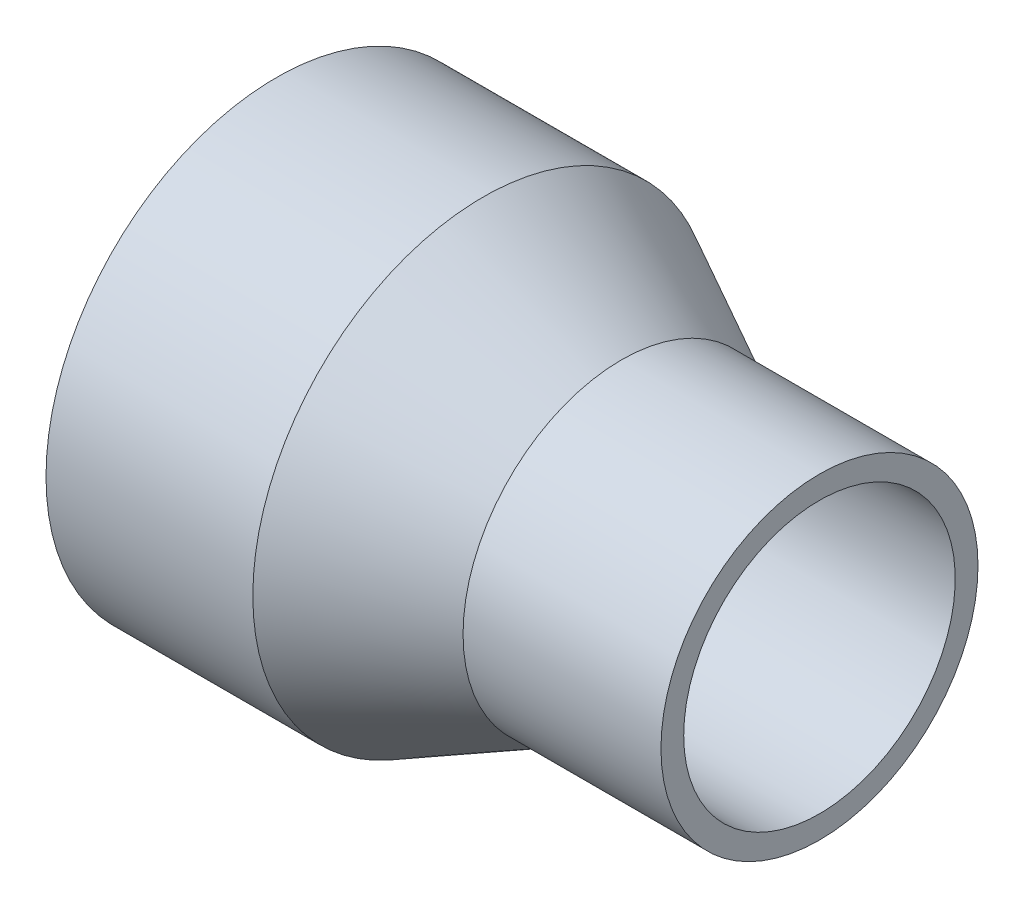
ISO-10303-21;
HEADER;
FILE_DESCRIPTION(('STEP AP214'),'2;1');
FILE_NAME('part.step','',(''),(''),'','','');
FILE_SCHEMA(('AUTOMOTIVE_DESIGN { 1 0 10303 214 1 1 1 1 }'));
ENDSEC;
DATA;
#1=APPLICATION_CONTEXT('core data for automotive mechanical design processes');
#2=APPLICATION_PROTOCOL_DEFINITION('international standard','automotive_design',2000,#1);
#3=PRODUCT_CONTEXT('',#1,'mechanical');
#4=PRODUCT('Part','Part','',(#3));
#5=PRODUCT_RELATED_PRODUCT_CATEGORY('part','',(#4));
#6=PRODUCT_DEFINITION_FORMATION('','',#4);
#7=PRODUCT_DEFINITION_CONTEXT('part definition',#1,'design');
#8=PRODUCT_DEFINITION('design','',#6,#7);
#9=PRODUCT_DEFINITION_SHAPE('','',#8);
#10=(LENGTH_UNIT() NAMED_UNIT(*) SI_UNIT(.MILLI.,.METRE.));
#11=(NAMED_UNIT(*) PLANE_ANGLE_UNIT() SI_UNIT($,.RADIAN.));
#12=(NAMED_UNIT(*) SI_UNIT($,.STERADIAN.) SOLID_ANGLE_UNIT());
#13=UNCERTAINTY_MEASURE_WITH_UNIT(LENGTH_MEASURE(1.E-05),#10,'distance_accuracy_value','');
#14=(GEOMETRIC_REPRESENTATION_CONTEXT(3) GLOBAL_UNCERTAINTY_ASSIGNED_CONTEXT((#13)) GLOBAL_UNIT_ASSIGNED_CONTEXT((#10,
#11,#12)) REPRESENTATION_CONTEXT('',''));
#15=CARTESIAN_POINT('',(0.,0.,0.));
#16=DIRECTION('',(0.,0.,1.));
#17=DIRECTION('',(1.,0.,0.));
#18=AXIS2_PLACEMENT_3D('',#15,#16,#17);
#19=CARTESIAN_POINT('',(101.6,0.,0.));
#20=DIRECTION('',(1.,0.,0.));
#21=DIRECTION('',(0.,0.,-1.));
#22=AXIS2_PLACEMENT_3D('',#19,#20,#21);
#23=PLANE('',#22);
#24=CARTESIAN_POINT('',(101.6,0.,0.));
#25=DIRECTION('',(-1.,0.,0.));
#26=DIRECTION('',(0.,0.,1.));
#27=AXIS2_PLACEMENT_3D('',#24,#25,#26);
#28=CIRCLE('',#27,25.4);
#29=CARTESIAN_POINT('',(101.6,0.,25.4));
#30=VERTEX_POINT('',#29);
#31=EDGE_CURVE('E61',#30,#30,#28,.T.);
#32=ORIENTED_EDGE('',*,*,#31,.T.);
#33=EDGE_LOOP('',(#32));
#34=FACE_BOUND('',#33,.T.);
#35=CARTESIAN_POINT('',(101.6,0.,0.));
#36=DIRECTION('',(-1.,0.,0.));
#37=DIRECTION('',(0.,0.,1.));
#38=AXIS2_PLACEMENT_3D('',#35,#36,#37);
#39=CIRCLE('',#38,29.6560239385366);
#40=CARTESIAN_POINT('',(101.6,0.,29.6560239385366));
#41=VERTEX_POINT('',#40);
#42=EDGE_CURVE('E10',#41,#41,#39,.T.);
#43=ORIENTED_EDGE('',*,*,#42,.F.);
#44=EDGE_LOOP('',(#43));
#45=FACE_BOUND('',#44,.T.);
#46=ADVANCED_FACE('F33',(#34,#45),#23,.T.);
#47=CARTESIAN_POINT('',(0.,0.,0.));
#48=DIRECTION('',(-1.,0.,0.));
#49=DIRECTION('',(0.,0.,1.));
#50=AXIS2_PLACEMENT_3D('',#47,#48,#49);
#51=CYLINDRICAL_SURFACE('',#50,29.6560239385366);
#52=ORIENTED_EDGE('',*,*,#42,.T.);
#53=EDGE_LOOP('',(#52));
#54=FACE_BOUND('',#53,.T.);
#55=CARTESIAN_POINT('',(64.5763811552156,0.,0.));
#56=DIRECTION('',(-1.,0.,0.));
#57=DIRECTION('',(0.,0.,1.));
#58=AXIS2_PLACEMENT_3D('',#55,#56,#57);
#59=CIRCLE('',#58,29.6560239385366);
#60=CARTESIAN_POINT('',(64.5763811552156,0.,29.6560239385366));
#61=VERTEX_POINT('',#60);
#62=EDGE_CURVE('E39',#61,#61,#59,.T.);
#63=ORIENTED_EDGE('',*,*,#62,.F.);
#64=EDGE_LOOP('',(#63));
#65=FACE_BOUND('',#64,.T.);
#66=ADVANCED_FACE('F79',(#54,#65),#51,.T.);
#67=CARTESIAN_POINT('',(38.691391355919,0.,0.));
#68=DIRECTION('',(-1.,0.,0.));
#69=DIRECTION('',(0.,0.,1.));
#70=AXIS2_PLACEMENT_3D('',#67,#68,#69);
#71=CONICAL_SURFACE('',#70,43.1,0.479025962413937);
#72=ORIENTED_EDGE('',*,*,#62,.T.);
#73=EDGE_LOOP('',(#72));
#74=FACE_BOUND('',#73,.T.);
#75=CARTESIAN_POINT('',(38.691391355919,0.,0.));
#76=DIRECTION('',(-1.,0.,0.));
#77=DIRECTION('',(0.,0.,1.));
#78=AXIS2_PLACEMENT_3D('',#75,#76,#77);
#79=CIRCLE('',#78,43.1);
#80=CARTESIAN_POINT('',(38.691391355919,0.,43.1));
#81=VERTEX_POINT('',#80);
#82=EDGE_CURVE('E43',#81,#81,#79,.T.);
#83=ORIENTED_EDGE('',*,*,#82,.F.);
#84=EDGE_LOOP('',(#83));
#85=FACE_BOUND('',#84,.T.);
#86=ADVANCED_FACE('F83',(#74,#85),#71,.T.);
#87=CARTESIAN_POINT('',(0.,0.,0.));
#88=DIRECTION('',(-1.,0.,0.));
#89=DIRECTION('',(0.,0.,1.));
#90=AXIS2_PLACEMENT_3D('',#87,#88,#89);
#91=CYLINDRICAL_SURFACE('',#90,43.1);
#92=ORIENTED_EDGE('',*,*,#82,.T.);
#93=EDGE_LOOP('',(#92));
#94=FACE_BOUND('',#93,.T.);
#95=CARTESIAN_POINT('',(0.,0.,0.));
#96=DIRECTION('',(-1.,0.,0.));
#97=DIRECTION('',(0.,0.,1.));
#98=AXIS2_PLACEMENT_3D('',#95,#96,#97);
#99=CIRCLE('',#98,43.1);
#100=CARTESIAN_POINT('',(0.,0.,43.1));
#101=VERTEX_POINT('',#100);
#102=EDGE_CURVE('E47',#101,#101,#99,.T.);
#103=ORIENTED_EDGE('',*,*,#102,.F.);
#104=EDGE_LOOP('',(#103));
#105=FACE_BOUND('',#104,.T.);
#106=ADVANCED_FACE('F87',(#94,#105),#91,.T.);
#107=CARTESIAN_POINT('',(0.,0.,0.));
#108=DIRECTION('',(-1.,0.,0.));
#109=DIRECTION('',(0.,0.,1.));
#110=AXIS2_PLACEMENT_3D('',#107,#108,#109);
#111=PLANE('',#110);
#112=ORIENTED_EDGE('',*,*,#102,.T.);
#113=EDGE_LOOP('',(#112));
#114=FACE_BOUND('',#113,.T.);
#115=CARTESIAN_POINT('',(0.,0.,0.));
#116=DIRECTION('',(-1.,0.,0.));
#117=DIRECTION('',(0.,0.,1.));
#118=AXIS2_PLACEMENT_3D('',#115,#116,#117);
#119=CIRCLE('',#118,38.1);
#120=CARTESIAN_POINT('',(0.,0.,38.1));
#121=VERTEX_POINT('',#120);
#122=EDGE_CURVE('E52',#121,#121,#119,.T.);
#123=ORIENTED_EDGE('',*,*,#122,.F.);
#124=EDGE_LOOP('',(#123));
#125=FACE_BOUND('',#124,.T.);
#126=ADVANCED_FACE('F93',(#114,#125),#111,.T.);
#127=CARTESIAN_POINT('',(0.,0.,0.));
#128=DIRECTION('',(-1.,0.,0.));
#129=DIRECTION('',(0.,0.,1.));
#130=AXIS2_PLACEMENT_3D('',#127,#128,#129);
#131=CYLINDRICAL_SURFACE('',#130,38.1);
#132=CARTESIAN_POINT('',(38.691391355919,0.,0.));
#133=DIRECTION('',(-1.,0.,0.));
#134=DIRECTION('',(0.,0.,1.));
#135=AXIS2_PLACEMENT_3D('',#132,#133,#134);
#136=CIRCLE('',#135,38.1);
#137=CARTESIAN_POINT('',(38.691391355919,0.,38.1));
#138=VERTEX_POINT('',#137);
#139=EDGE_CURVE('E55',#138,#138,#136,.T.);
#140=ORIENTED_EDGE('',*,*,#139,.F.);
#141=EDGE_LOOP('',(#140));
#142=FACE_BOUND('',#141,.T.);
#143=ORIENTED_EDGE('',*,*,#122,.T.);
#144=EDGE_LOOP('',(#143));
#145=FACE_BOUND('',#144,.T.);
#146=ADVANCED_FACE('F75',(#142,#145),#131,.F.);
#147=CARTESIAN_POINT('',(64.5763811552156,0.,0.));
#148=DIRECTION('',(-1.,0.,0.));
#149=DIRECTION('',(0.,0.,1.));
#150=AXIS2_PLACEMENT_3D('',#147,#148,#149);
#151=CONICAL_SURFACE('',#150,25.4,0.456125027888131);
#152=ORIENTED_EDGE('',*,*,#139,.T.);
#153=EDGE_LOOP('',(#152));
#154=FACE_BOUND('',#153,.T.);
#155=CARTESIAN_POINT('',(64.5763811552156,0.,0.));
#156=DIRECTION('',(-1.,0.,0.));
#157=DIRECTION('',(0.,0.,1.));
#158=AXIS2_PLACEMENT_3D('',#155,#156,#157);
#159=CIRCLE('',#158,25.4);
#160=CARTESIAN_POINT('',(64.5763811552156,0.,25.4));
#161=VERTEX_POINT('',#160);
#162=EDGE_CURVE('E58',#161,#161,#159,.T.);
#163=ORIENTED_EDGE('',*,*,#162,.F.);
#164=EDGE_LOOP('',(#163));
#165=FACE_BOUND('',#164,.T.);
#166=ADVANCED_FACE('F69',(#154,#165),#151,.F.);
#167=CARTESIAN_POINT('',(0.,0.,0.));
#168=DIRECTION('',(-1.,0.,0.));
#169=DIRECTION('',(0.,0.,1.));
#170=AXIS2_PLACEMENT_3D('',#167,#168,#169);
#171=CYLINDRICAL_SURFACE('',#170,25.4);
#172=ORIENTED_EDGE('',*,*,#162,.T.);
#173=EDGE_LOOP('',(#172));
#174=FACE_BOUND('',#173,.T.);
#175=ORIENTED_EDGE('',*,*,#31,.F.);
#176=EDGE_LOOP('',(#175));
#177=FACE_BOUND('',#176,.T.);
#178=ADVANCED_FACE('F67',(#174,#177),#171,.F.);
#179=CLOSED_SHELL('',(#46,#66,#86,#106,#126,#146,#166,#178));
#180=MANIFOLD_SOLID_BREP('B2',#179);
#181=ADVANCED_BREP_SHAPE_REPRESENTATION('',(#18,#180),#14);
#182=SHAPE_DEFINITION_REPRESENTATION(#9,#181);
ENDSEC;
END-ISO-10303-21;
